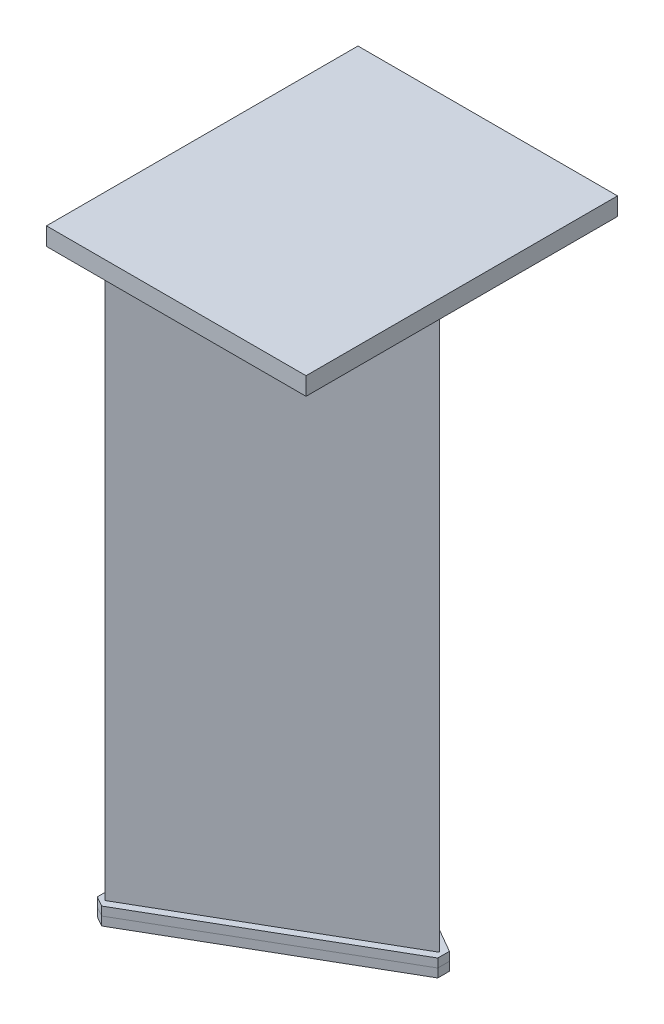
ISO-10303-21;
HEADER;
FILE_DESCRIPTION(('STEP AP214'),'2;1');
FILE_NAME('part.step','',(''),(''),'','','');
FILE_SCHEMA(('AUTOMOTIVE_DESIGN { 1 0 10303 214 1 1 1 1 }'));
ENDSEC;
DATA;
#1=APPLICATION_CONTEXT('core data for automotive mechanical design processes');
#2=APPLICATION_PROTOCOL_DEFINITION('international standard','automotive_design',2000,#1);
#3=PRODUCT_CONTEXT('',#1,'mechanical');
#4=PRODUCT('Part','Part','',(#3));
#5=PRODUCT_RELATED_PRODUCT_CATEGORY('part','',(#4));
#6=PRODUCT_DEFINITION_FORMATION('','',#4);
#7=PRODUCT_DEFINITION_CONTEXT('part definition',#1,'design');
#8=PRODUCT_DEFINITION('design','',#6,#7);
#9=PRODUCT_DEFINITION_SHAPE('','',#8);
#10=(LENGTH_UNIT() NAMED_UNIT(*) SI_UNIT(.MILLI.,.METRE.));
#11=(NAMED_UNIT(*) PLANE_ANGLE_UNIT() SI_UNIT($,.RADIAN.));
#12=(NAMED_UNIT(*) SI_UNIT($,.STERADIAN.) SOLID_ANGLE_UNIT());
#13=UNCERTAINTY_MEASURE_WITH_UNIT(LENGTH_MEASURE(1.E-05),#10,'distance_accuracy_value','');
#14=(GEOMETRIC_REPRESENTATION_CONTEXT(3) GLOBAL_UNCERTAINTY_ASSIGNED_CONTEXT((#13)) GLOBAL_UNIT_ASSIGNED_CONTEXT((#10,
#11,#12)) REPRESENTATION_CONTEXT('',''));
#15=CARTESIAN_POINT('',(0.,0.,0.));
#16=DIRECTION('',(0.,0.,1.));
#17=DIRECTION('',(1.,0.,0.));
#18=AXIS2_PLACEMENT_3D('',#15,#16,#17);
#19=CARTESIAN_POINT('',(-198.697304509099,-25.4,378.291426736751));
#20=DIRECTION('',(0.499999999999992,0.,-0.866025403784443));
#21=DIRECTION('',(-0.866025403784443,0.,-0.499999999999992));
#22=AXIS2_PLACEMENT_3D('',#19,#20,#21);
#23=PLANE('',#22);
#24=DIRECTION('',(-0.866025403784443,0.,-0.499999999999992));
#25=VECTOR('',#24,1.);
#26=CARTESIAN_POINT('',(-198.697304509099,0.,378.291426736751));
#27=LINE('',#26,#25);
#28=CARTESIAN_POINT('',(-198.697304509099,0.,378.291426736751));
#29=VERTEX_POINT('',#28);
#30=CARTESIAN_POINT('',(-228.261333333331,0.,361.222626736751));
#31=VERTEX_POINT('',#30);
#32=EDGE_CURVE('E128',#29,#31,#27,.T.);
#33=ORIENTED_EDGE('',*,*,#32,.T.);
#34=DIRECTION('',(0.,1.,0.));
#35=VECTOR('',#34,1.);
#36=CARTESIAN_POINT('',(-228.261333333331,-25.4,361.222626736751));
#37=LINE('',#36,#35);
#38=CARTESIAN_POINT('',(-228.261333333331,-25.4,361.222626736751));
#39=VERTEX_POINT('',#38);
#40=EDGE_CURVE('E12',#39,#31,#37,.T.);
#41=ORIENTED_EDGE('',*,*,#40,.F.);
#42=DIRECTION('',(-0.866025403784443,0.,-0.499999999999992));
#43=VECTOR('',#42,1.);
#44=CARTESIAN_POINT('',(-198.697304509099,-25.4,378.291426736751));
#45=LINE('',#44,#43);
#46=CARTESIAN_POINT('',(-198.697304509099,-25.4,378.291426736751));
#47=VERTEX_POINT('',#46);
#48=EDGE_CURVE('E138',#47,#39,#45,.T.);
#49=ORIENTED_EDGE('',*,*,#48,.F.);
#50=DIRECTION('',(0.,1.,0.));
#51=VECTOR('',#50,1.);
#52=CARTESIAN_POINT('',(-198.697304509099,-25.4,378.291426736751));
#53=LINE('',#52,#51);
#54=EDGE_CURVE('E124',#47,#29,#53,.T.);
#55=ORIENTED_EDGE('',*,*,#54,.T.);
#56=EDGE_LOOP('',(#33,#41,#49,#55));
#57=FACE_BOUND('',#56,.T.);
#58=ADVANCED_FACE('F44',(#57),#23,.F.);
#59=CARTESIAN_POINT('',(-228.261333333331,-25.4,361.222626736751));
#60=DIRECTION('',(1.,0.,0.));
#61=DIRECTION('',(0.,0.,-1.));
#62=AXIS2_PLACEMENT_3D('',#59,#60,#61);
#63=PLANE('',#62);
#64=DIRECTION('',(0.,0.,-1.));
#65=VECTOR('',#64,1.);
#66=CARTESIAN_POINT('',(-228.261333333331,0.,361.222626736751));
#67=LINE('',#66,#65);
#68=CARTESIAN_POINT('',(-228.261333333335,0.,-361.222626736746));
#69=VERTEX_POINT('',#68);
#70=EDGE_CURVE('E131',#31,#69,#67,.T.);
#71=ORIENTED_EDGE('',*,*,#70,.T.);
#72=DIRECTION('',(0.,1.,0.));
#73=VECTOR('',#72,1.);
#74=CARTESIAN_POINT('',(-228.261333333335,-25.4,-361.222626736746));
#75=LINE('',#74,#73);
#76=CARTESIAN_POINT('',(-228.261333333335,-25.4,-361.222626736746));
#77=VERTEX_POINT('',#76);
#78=EDGE_CURVE('E52',#77,#69,#75,.T.);
#79=ORIENTED_EDGE('',*,*,#78,.F.);
#80=DIRECTION('',(0.,0.,-1.));
#81=VECTOR('',#80,1.);
#82=CARTESIAN_POINT('',(-228.261333333331,-25.4,361.222626736751));
#83=LINE('',#82,#81);
#84=EDGE_CURVE('E97',#39,#77,#83,.T.);
#85=ORIENTED_EDGE('',*,*,#84,.F.);
#86=ORIENTED_EDGE('',*,*,#40,.T.);
#87=EDGE_LOOP('',(#71,#79,#85,#86));
#88=FACE_BOUND('',#87,.T.);
#89=ADVANCED_FACE('F162',(#88),#63,.F.);
#90=CARTESIAN_POINT('',(-228.261333333335,-25.4,-361.222626736746));
#91=DIRECTION('',(0.500000000000007,0.,0.866025403784435));
#92=DIRECTION('',(0.866025403784435,0.,-0.500000000000007));
#93=AXIS2_PLACEMENT_3D('',#90,#91,#92);
#94=PLANE('',#93);
#95=DIRECTION('',(0.866025403784435,0.,-0.500000000000007));
#96=VECTOR('',#95,1.);
#97=CARTESIAN_POINT('',(-228.261333333335,0.,-361.222626736746));
#98=LINE('',#97,#96);
#99=CARTESIAN_POINT('',(-198.697304509104,0.,-378.291426736747));
#100=VERTEX_POINT('',#99);
#101=EDGE_CURVE('E133',#69,#100,#98,.T.);
#102=ORIENTED_EDGE('',*,*,#101,.T.);
#103=DIRECTION('',(0.,1.,0.));
#104=VECTOR('',#103,1.);
#105=CARTESIAN_POINT('',(-198.697304509104,-25.4,-378.291426736747));
#106=LINE('',#105,#104);
#107=CARTESIAN_POINT('',(-198.697304509104,-25.4,-378.291426736747));
#108=VERTEX_POINT('',#107);
#109=EDGE_CURVE('E119',#108,#100,#106,.T.);
#110=ORIENTED_EDGE('',*,*,#109,.F.);
#111=DIRECTION('',(0.866025403784435,0.,-0.500000000000007));
#112=VECTOR('',#111,1.);
#113=CARTESIAN_POINT('',(-228.261333333335,-25.4,-361.222626736746));
#114=LINE('',#113,#112);
#115=EDGE_CURVE('E110',#77,#108,#114,.T.);
#116=ORIENTED_EDGE('',*,*,#115,.F.);
#117=ORIENTED_EDGE('',*,*,#78,.T.);
#118=EDGE_LOOP('',(#102,#110,#116,#117));
#119=FACE_BOUND('',#118,.T.);
#120=ADVANCED_FACE('F144',(#119),#94,.F.);
#121=CARTESIAN_POINT('',(-198.697304509104,-25.4,-378.291426736747));
#122=DIRECTION('',(-0.499999999999995,0.,0.866025403784442));
#123=DIRECTION('',(0.866025403784442,0.,0.499999999999995));
#124=AXIS2_PLACEMENT_3D('',#121,#122,#123);
#125=PLANE('',#124);
#126=DIRECTION('',(0.866025403784442,0.,0.499999999999995));
#127=VECTOR('',#126,1.);
#128=CARTESIAN_POINT('',(-198.697304509104,0.,-378.291426736747));
#129=LINE('',#128,#127);
#130=CARTESIAN_POINT('',(426.958637842435,0.,-17.0688000000018));
#131=VERTEX_POINT('',#130);
#132=EDGE_CURVE('E118',#100,#131,#129,.T.);
#133=ORIENTED_EDGE('',*,*,#132,.T.);
#134=DIRECTION('',(0.,1.,0.));
#135=VECTOR('',#134,1.);
#136=CARTESIAN_POINT('',(426.958637842435,-25.4,-17.0688000000018));
#137=LINE('',#136,#135);
#138=CARTESIAN_POINT('',(426.958637842435,-25.4,-17.0688000000018));
#139=VERTEX_POINT('',#138);
#140=EDGE_CURVE('E115',#139,#131,#137,.T.);
#141=ORIENTED_EDGE('',*,*,#140,.F.);
#142=DIRECTION('',(0.866025403784442,0.,0.499999999999995));
#143=VECTOR('',#142,1.);
#144=CARTESIAN_POINT('',(-198.697304509104,-25.4,-378.291426736747));
#145=LINE('',#144,#143);
#146=EDGE_CURVE('E104',#108,#139,#145,.T.);
#147=ORIENTED_EDGE('',*,*,#146,.F.);
#148=ORIENTED_EDGE('',*,*,#109,.T.);
#149=EDGE_LOOP('',(#133,#141,#147,#148));
#150=FACE_BOUND('',#149,.T.);
#151=ADVANCED_FACE('F116',(#150),#125,.F.);
#152=CARTESIAN_POINT('',(426.958637842435,-25.4,-17.0688000000018));
#153=DIRECTION('',(-1.,0.,0.));
#154=DIRECTION('',(0.,0.,1.));
#155=AXIS2_PLACEMENT_3D('',#152,#153,#154);
#156=PLANE('',#155);
#157=DIRECTION('',(0.,0.,1.));
#158=VECTOR('',#157,1.);
#159=CARTESIAN_POINT('',(426.958637842435,0.,-17.0688000000018));
#160=LINE('',#159,#158);
#161=CARTESIAN_POINT('',(426.958637842435,0.,17.0687999999982));
#162=VERTEX_POINT('',#161);
#163=EDGE_CURVE('E83',#131,#162,#160,.T.);
#164=ORIENTED_EDGE('',*,*,#163,.T.);
#165=DIRECTION('',(0.,1.,0.));
#166=VECTOR('',#165,1.);
#167=CARTESIAN_POINT('',(426.958637842435,-25.4,17.0687999999982));
#168=LINE('',#167,#166);
#169=CARTESIAN_POINT('',(426.958637842435,-25.4,17.0687999999982));
#170=VERTEX_POINT('',#169);
#171=EDGE_CURVE('E120',#170,#162,#168,.T.);
#172=ORIENTED_EDGE('',*,*,#171,.F.);
#173=DIRECTION('',(0.,0.,1.));
#174=VECTOR('',#173,1.);
#175=CARTESIAN_POINT('',(426.958637842435,-25.4,-17.0688000000018));
#176=LINE('',#175,#174);
#177=EDGE_CURVE('E108',#139,#170,#176,.T.);
#178=ORIENTED_EDGE('',*,*,#177,.F.);
#179=ORIENTED_EDGE('',*,*,#140,.T.);
#180=EDGE_LOOP('',(#164,#172,#178,#179));
#181=FACE_BOUND('',#180,.T.);
#182=ADVANCED_FACE('F122',(#181),#156,.F.);
#183=CARTESIAN_POINT('',(426.958637842435,-25.4,17.0687999999982));
#184=DIRECTION('',(-0.500000000000005,0.,-0.866025403784436));
#185=DIRECTION('',(-0.866025403784436,0.,0.500000000000005));
#186=AXIS2_PLACEMENT_3D('',#183,#184,#185);
#187=PLANE('',#186);
#188=DIRECTION('',(-0.866025403784436,0.,0.500000000000005));
#189=VECTOR('',#188,1.);
#190=CARTESIAN_POINT('',(426.958637842435,0.,17.0687999999982));
#191=LINE('',#190,#189);
#192=EDGE_CURVE('E89',#162,#29,#191,.T.);
#193=ORIENTED_EDGE('',*,*,#192,.T.);
#194=ORIENTED_EDGE('',*,*,#54,.F.);
#195=DIRECTION('',(-0.866025403784436,0.,0.500000000000005));
#196=VECTOR('',#195,1.);
#197=CARTESIAN_POINT('',(426.958637842435,-25.4,17.0687999999982));
#198=LINE('',#197,#196);
#199=EDGE_CURVE('E60',#170,#47,#198,.T.);
#200=ORIENTED_EDGE('',*,*,#199,.F.);
#201=ORIENTED_EDGE('',*,*,#171,.T.);
#202=EDGE_LOOP('',(#193,#194,#200,#201));
#203=FACE_BOUND('',#202,.T.);
#204=ADVANCED_FACE('F151',(#203),#187,.F.);
#205=CARTESIAN_POINT('',(-228.261333333331,-25.4,361.222626736751));
#206=DIRECTION('',(0.,-1.,0.));
#207=DIRECTION('',(0.,0.,-1.));
#208=AXIS2_PLACEMENT_3D('',#205,#206,#207);
#209=PLANE('',#208);
#210=ORIENTED_EDGE('',*,*,#48,.T.);
#211=ORIENTED_EDGE('',*,*,#84,.T.);
#212=ORIENTED_EDGE('',*,*,#115,.T.);
#213=ORIENTED_EDGE('',*,*,#146,.T.);
#214=ORIENTED_EDGE('',*,*,#177,.T.);
#215=ORIENTED_EDGE('',*,*,#199,.T.);
#216=EDGE_LOOP('',(#210,#211,#212,#213,#214,#215));
#217=FACE_BOUND('',#216,.T.);
#218=ADVANCED_FACE('F106',(#217),#209,.T.);
#219=CARTESIAN_POINT('',(-228.261333333331,0.,361.222626736751));
#220=DIRECTION('',(0.,-1.,0.));
#221=DIRECTION('',(0.,0.,-1.));
#222=AXIS2_PLACEMENT_3D('',#219,#220,#221);
#223=PLANE('',#222);
#224=ORIENTED_EDGE('',*,*,#32,.F.);
#225=ORIENTED_EDGE('',*,*,#192,.F.);
#226=ORIENTED_EDGE('',*,*,#163,.F.);
#227=ORIENTED_EDGE('',*,*,#132,.F.);
#228=ORIENTED_EDGE('',*,*,#101,.F.);
#229=ORIENTED_EDGE('',*,*,#70,.F.);
#230=EDGE_LOOP('',(#224,#225,#226,#227,#228,#229));
#231=FACE_BOUND('',#230,.T.);
#232=ADVANCED_FACE('F147',(#231),#223,.F.);
#233=CLOSED_SHELL('',(#58,#89,#120,#151,#182,#204,#218,#232));
#234=MANIFOLD_SOLID_BREP('B2',#233);
#235=CARTESIAN_POINT('',(-207.433333333338,2650.72795165701,-359.285072516704));
#236=DIRECTION('',(0.5,0.,-0.866025403784438));
#237=DIRECTION('',(-0.866025403784438,0.,-0.5));
#238=AXIS2_PLACEMENT_3D('',#235,#236,#237);
#239=PLANE('',#238);
#240=DIRECTION('',(-0.866025403784438,0.,-0.5));
#241=VECTOR('',#240,1.);
#242=CARTESIAN_POINT('',(-207.433333333338,1700.149,-359.285072516704));
#243=LINE('',#242,#241);
#244=CARTESIAN_POINT('',(414.866666666662,1700.149,1.0886965094513E-13));
#245=VERTEX_POINT('',#244);
#246=CARTESIAN_POINT('',(-207.433333333338,1700.149,-359.285072516704));
#247=VERTEX_POINT('',#246);
#248=EDGE_CURVE('E238',#245,#247,#243,.T.);
#249=ORIENTED_EDGE('',*,*,#248,.F.);
#250=DIRECTION('',(0.,-1.,0.));
#251=VECTOR('',#250,1.);
#252=CARTESIAN_POINT('',(414.866666666662,2650.72795165701,0.));
#253=LINE('',#252,#251);
#254=CARTESIAN_POINT('',(414.866666666662,25.4,0.));
#255=VERTEX_POINT('',#254);
#256=EDGE_CURVE('E258',#245,#255,#253,.T.);
#257=ORIENTED_EDGE('',*,*,#256,.T.);
#258=DIRECTION('',(0.866025403784438,0.,0.5));
#259=VECTOR('',#258,1.);
#260=CARTESIAN_POINT('',(-207.433333333338,25.4,-359.285072516704));
#261=LINE('',#260,#259);
#262=CARTESIAN_POINT('',(-207.433333333338,25.4,-359.285072516704));
#263=VERTEX_POINT('',#262);
#264=EDGE_CURVE('E262',#263,#255,#261,.T.);
#265=ORIENTED_EDGE('',*,*,#264,.F.);
#266=DIRECTION('',(0.,-1.,0.));
#267=VECTOR('',#266,1.);
#268=CARTESIAN_POINT('',(-207.433333333338,2650.72795165701,-359.285072516704));
#269=LINE('',#268,#267);
#270=EDGE_CURVE('E280',#247,#263,#269,.T.);
#271=ORIENTED_EDGE('',*,*,#270,.F.);
#272=EDGE_LOOP('',(#249,#257,#265,#271));
#273=FACE_BOUND('',#272,.T.);
#274=ADVANCED_FACE('F230',(#273),#239,.T.);
#275=CARTESIAN_POINT('',(-207.433333333338,2650.72795165701,359.285072516704));
#276=DIRECTION('',(-1.,0.,0.));
#277=DIRECTION('',(0.,0.,1.));
#278=AXIS2_PLACEMENT_3D('',#275,#276,#277);
#279=PLANE('',#278);
#280=DIRECTION('',(0.,0.,1.));
#281=VECTOR('',#280,1.);
#282=CARTESIAN_POINT('',(-207.433333333338,1700.149,359.285072516704));
#283=LINE('',#282,#281);
#284=CARTESIAN_POINT('',(-207.433333333338,1700.149,359.285072516704));
#285=VERTEX_POINT('',#284);
#286=EDGE_CURVE('E282',#247,#285,#283,.T.);
#287=ORIENTED_EDGE('',*,*,#286,.F.);
#288=ORIENTED_EDGE('',*,*,#270,.T.);
#289=DIRECTION('',(0.,0.,-1.));
#290=VECTOR('',#289,1.);
#291=CARTESIAN_POINT('',(-207.433333333338,25.4,359.285072516704));
#292=LINE('',#291,#290);
#293=CARTESIAN_POINT('',(-207.433333333338,25.4,359.285072516704));
#294=VERTEX_POINT('',#293);
#295=EDGE_CURVE('E266',#294,#263,#292,.T.);
#296=ORIENTED_EDGE('',*,*,#295,.F.);
#297=DIRECTION('',(0.,-1.,0.));
#298=VECTOR('',#297,1.);
#299=CARTESIAN_POINT('',(-207.433333333338,2650.72795165701,359.285072516704));
#300=LINE('',#299,#298);
#301=EDGE_CURVE('E265',#285,#294,#300,.T.);
#302=ORIENTED_EDGE('',*,*,#301,.F.);
#303=EDGE_LOOP('',(#287,#288,#296,#302));
#304=FACE_BOUND('',#303,.T.);
#305=ADVANCED_FACE('F286',(#304),#279,.T.);
#306=CARTESIAN_POINT('',(414.866666666662,2650.72795165701,0.));
#307=DIRECTION('',(0.5,0.,0.866025403784439));
#308=DIRECTION('',(0.866025403784439,0.,-0.5));
#309=AXIS2_PLACEMENT_3D('',#306,#307,#308);
#310=PLANE('',#309);
#311=DIRECTION('',(0.866025403784439,0.,-0.5));
#312=VECTOR('',#311,1.);
#313=CARTESIAN_POINT('',(414.866666666662,1700.149,0.));
#314=LINE('',#313,#312);
#315=EDGE_CURVE('E42',#285,#245,#314,.T.);
#316=ORIENTED_EDGE('',*,*,#315,.F.);
#317=ORIENTED_EDGE('',*,*,#301,.T.);
#318=DIRECTION('',(-0.866025403784439,0.,0.5));
#319=VECTOR('',#318,1.);
#320=CARTESIAN_POINT('',(414.866666666662,25.4,0.));
#321=LINE('',#320,#319);
#322=EDGE_CURVE('E268',#255,#294,#321,.T.);
#323=ORIENTED_EDGE('',*,*,#322,.F.);
#324=ORIENTED_EDGE('',*,*,#256,.F.);
#325=EDGE_LOOP('',(#316,#317,#323,#324));
#326=FACE_BOUND('',#325,.T.);
#327=ADVANCED_FACE('F269',(#326),#310,.T.);
#328=CARTESIAN_POINT('',(414.866666666662,25.4,1.32208155744464E-13));
#329=DIRECTION('',(0.,-1.,0.));
#330=DIRECTION('',(0.,0.,-1.));
#331=AXIS2_PLACEMENT_3D('',#328,#329,#330);
#332=PLANE('',#331);
#333=ORIENTED_EDGE('',*,*,#264,.T.);
#334=ORIENTED_EDGE('',*,*,#322,.T.);
#335=ORIENTED_EDGE('',*,*,#295,.T.);
#336=EDGE_LOOP('',(#333,#334,#335));
#337=FACE_BOUND('',#336,.T.);
#338=ADVANCED_FACE('F274',(#337),#332,.T.);
#339=CARTESIAN_POINT('',(-281.65134774545,1700.149,-457.2));
#340=DIRECTION('',(0.,-1.,0.));
#341=DIRECTION('',(0.,0.,-1.));
#342=AXIS2_PLACEMENT_3D('',#339,#340,#341);
#343=PLANE('',#342);
#344=ORIENTED_EDGE('',*,*,#248,.T.);
#345=ORIENTED_EDGE('',*,*,#286,.T.);
#346=ORIENTED_EDGE('',*,*,#315,.T.);
#347=EDGE_LOOP('',(#344,#345,#346));
#348=FACE_BOUND('',#347,.T.);
#349=ADVANCED_FACE('F285',(#348),#343,.F.);
#350=CLOSED_SHELL('',(#274,#305,#327,#338,#349));
#351=MANIFOLD_SOLID_BREP('B6',#350);
#352=CARTESIAN_POINT('',(-281.65134774545,1700.149,457.2));
#353=DIRECTION('',(-1.,0.,0.));
#354=DIRECTION('',(0.,0.,1.));
#355=AXIS2_PLACEMENT_3D('',#352,#353,#354);
#356=PLANE('',#355);
#357=DIRECTION('',(0.,0.,1.));
#358=VECTOR('',#357,1.);
#359=CARTESIAN_POINT('',(-281.65134774545,1752.6,457.2));
#360=LINE('',#359,#358);
#361=CARTESIAN_POINT('',(-281.65134774545,1752.6,-457.2));
#362=VERTEX_POINT('',#361);
#363=CARTESIAN_POINT('',(-281.65134774545,1752.6,457.2));
#364=VERTEX_POINT('',#363);
#365=EDGE_CURVE('E401',#362,#364,#360,.T.);
#366=ORIENTED_EDGE('',*,*,#365,.F.);
#367=DIRECTION('',(0.,1.,0.));
#368=VECTOR('',#367,1.);
#369=CARTESIAN_POINT('',(-281.65134774545,1700.149,-457.2));
#370=LINE('',#369,#368);
#371=CARTESIAN_POINT('',(-281.65134774545,1700.149,-457.2));
#372=VERTEX_POINT('',#371);
#373=EDGE_CURVE('E228',#372,#362,#370,.T.);
#374=ORIENTED_EDGE('',*,*,#373,.F.);
#375=DIRECTION('',(0.,0.,1.));
#376=VECTOR('',#375,1.);
#377=CARTESIAN_POINT('',(-281.65134774545,1700.149,457.2));
#378=LINE('',#377,#376);
#379=CARTESIAN_POINT('',(-281.65134774545,1700.149,457.2));
#380=VERTEX_POINT('',#379);
#381=EDGE_CURVE('E395',#372,#380,#378,.T.);
#382=ORIENTED_EDGE('',*,*,#381,.T.);
#383=DIRECTION('',(0.,1.,0.));
#384=VECTOR('',#383,1.);
#385=CARTESIAN_POINT('',(-281.65134774545,1700.149,457.2));
#386=LINE('',#385,#384);
#387=EDGE_CURVE('E340',#380,#364,#386,.T.);
#388=ORIENTED_EDGE('',*,*,#387,.T.);
#389=EDGE_LOOP('',(#366,#374,#382,#388));
#390=FACE_BOUND('',#389,.T.);
#391=ADVANCED_FACE('F337',(#390),#356,.T.);
#392=CARTESIAN_POINT('',(-281.65134774545,1700.149,-457.2));
#393=DIRECTION('',(0.,0.,-1.));
#394=DIRECTION('',(-1.,0.,0.));
#395=AXIS2_PLACEMENT_3D('',#392,#393,#394);
#396=PLANE('',#395);
#397=DIRECTION('',(-1.,0.,0.));
#398=VECTOR('',#397,1.);
#399=CARTESIAN_POINT('',(-281.65134774545,1752.6,-457.2));
#400=LINE('',#399,#398);
#401=CARTESIAN_POINT('',(480.34865225455,1752.6,-457.2));
#402=VERTEX_POINT('',#401);
#403=EDGE_CURVE('E397',#402,#362,#400,.T.);
#404=ORIENTED_EDGE('',*,*,#403,.F.);
#405=DIRECTION('',(0.,1.,0.));
#406=VECTOR('',#405,1.);
#407=CARTESIAN_POINT('',(480.34865225455,1700.149,-457.2));
#408=LINE('',#407,#406);
#409=CARTESIAN_POINT('',(480.34865225455,1700.149,-457.2));
#410=VERTEX_POINT('',#409);
#411=EDGE_CURVE('E346',#410,#402,#408,.T.);
#412=ORIENTED_EDGE('',*,*,#411,.F.);
#413=DIRECTION('',(-1.,0.,0.));
#414=VECTOR('',#413,1.);
#415=CARTESIAN_POINT('',(-281.65134774545,1700.149,-457.2));
#416=LINE('',#415,#414);
#417=EDGE_CURVE('E392',#410,#372,#416,.T.);
#418=ORIENTED_EDGE('',*,*,#417,.T.);
#419=ORIENTED_EDGE('',*,*,#373,.T.);
#420=EDGE_LOOP('',(#404,#412,#418,#419));
#421=FACE_BOUND('',#420,.T.);
#422=ADVANCED_FACE('F411',(#421),#396,.T.);
#423=CARTESIAN_POINT('',(480.34865225455,1700.149,457.2));
#424=DIRECTION('',(1.,0.,0.));
#425=DIRECTION('',(0.,0.,-1.));
#426=AXIS2_PLACEMENT_3D('',#423,#424,#425);
#427=PLANE('',#426);
#428=DIRECTION('',(0.,0.,-1.));
#429=VECTOR('',#428,1.);
#430=CARTESIAN_POINT('',(480.34865225455,1752.6,457.2));
#431=LINE('',#430,#429);
#432=CARTESIAN_POINT('',(480.34865225455,1752.6,457.2));
#433=VERTEX_POINT('',#432);
#434=EDGE_CURVE('E387',#433,#402,#431,.T.);
#435=ORIENTED_EDGE('',*,*,#434,.F.);
#436=DIRECTION('',(0.,1.,0.));
#437=VECTOR('',#436,1.);
#438=CARTESIAN_POINT('',(480.34865225455,1700.149,457.2));
#439=LINE('',#438,#437);
#440=CARTESIAN_POINT('',(480.34865225455,1700.149,457.2));
#441=VERTEX_POINT('',#440);
#442=EDGE_CURVE('E382',#441,#433,#439,.T.);
#443=ORIENTED_EDGE('',*,*,#442,.F.);
#444=DIRECTION('',(0.,0.,-1.));
#445=VECTOR('',#444,1.);
#446=CARTESIAN_POINT('',(480.34865225455,1700.149,457.2));
#447=LINE('',#446,#445);
#448=EDGE_CURVE('E385',#441,#410,#447,.T.);
#449=ORIENTED_EDGE('',*,*,#448,.T.);
#450=ORIENTED_EDGE('',*,*,#411,.T.);
#451=EDGE_LOOP('',(#435,#443,#449,#450));
#452=FACE_BOUND('',#451,.T.);
#453=ADVANCED_FACE('F384',(#452),#427,.T.);
#454=CARTESIAN_POINT('',(-281.65134774545,1700.149,457.2));
#455=DIRECTION('',(0.,0.,1.));
#456=DIRECTION('',(1.,0.,0.));
#457=AXIS2_PLACEMENT_3D('',#454,#455,#456);
#458=PLANE('',#457);
#459=DIRECTION('',(1.,0.,0.));
#460=VECTOR('',#459,1.);
#461=CARTESIAN_POINT('',(-281.65134774545,1752.6,457.2));
#462=LINE('',#461,#460);
#463=EDGE_CURVE('E404',#364,#433,#462,.T.);
#464=ORIENTED_EDGE('',*,*,#463,.F.);
#465=ORIENTED_EDGE('',*,*,#387,.F.);
#466=DIRECTION('',(1.,0.,0.));
#467=VECTOR('',#466,1.);
#468=CARTESIAN_POINT('',(-281.65134774545,1700.149,457.2));
#469=LINE('',#468,#467);
#470=EDGE_CURVE('E391',#380,#441,#469,.T.);
#471=ORIENTED_EDGE('',*,*,#470,.T.);
#472=ORIENTED_EDGE('',*,*,#442,.T.);
#473=EDGE_LOOP('',(#464,#465,#471,#472));
#474=FACE_BOUND('',#473,.T.);
#475=ADVANCED_FACE('F394',(#474),#458,.T.);
#476=CARTESIAN_POINT('',(-281.65134774545,1700.149,-457.2));
#477=DIRECTION('',(0.,-1.,0.));
#478=DIRECTION('',(0.,0.,-1.));
#479=AXIS2_PLACEMENT_3D('',#476,#477,#478);
#480=PLANE('',#479);
#481=ORIENTED_EDGE('',*,*,#381,.F.);
#482=ORIENTED_EDGE('',*,*,#417,.F.);
#483=ORIENTED_EDGE('',*,*,#448,.F.);
#484=ORIENTED_EDGE('',*,*,#470,.F.);
#485=EDGE_LOOP('',(#481,#482,#483,#484));
#486=FACE_BOUND('',#485,.T.);
#487=ADVANCED_FACE('F390',(#486),#480,.T.);
#488=CARTESIAN_POINT('',(-281.65134774545,1752.6,-457.2));
#489=DIRECTION('',(0.,-1.,0.));
#490=DIRECTION('',(0.,0.,-1.));
#491=AXIS2_PLACEMENT_3D('',#488,#489,#490);
#492=PLANE('',#491);
#493=ORIENTED_EDGE('',*,*,#365,.T.);
#494=ORIENTED_EDGE('',*,*,#463,.T.);
#495=ORIENTED_EDGE('',*,*,#434,.T.);
#496=ORIENTED_EDGE('',*,*,#403,.T.);
#497=EDGE_LOOP('',(#493,#494,#495,#496));
#498=FACE_BOUND('',#497,.T.);
#499=ADVANCED_FACE('F410',(#498),#492,.F.);
#500=CLOSED_SHELL('',(#391,#422,#453,#475,#487,#499));
#501=MANIFOLD_SOLID_BREP('B36',#500);
#502=CARTESIAN_POINT('',(-228.261333333335,25.4,-361.222626736746));
#503=DIRECTION('',(0.500000000000006,0.,0.866025403784435));
#504=DIRECTION('',(0.866025403784435,0.,-0.500000000000006));
#505=AXIS2_PLACEMENT_3D('',#502,#503,#504);
#506=PLANE('',#505);
#507=DIRECTION('',(-0.866025403784435,0.,0.500000000000006));
#508=VECTOR('',#507,1.);
#509=CARTESIAN_POINT('',(-228.261333333335,0.,-361.222626736746));
#510=LINE('',#509,#508);
#511=CARTESIAN_POINT('',(-198.697304509104,0.,-378.291426736747));
#512=VERTEX_POINT('',#511);
#513=CARTESIAN_POINT('',(-228.261333333335,0.,-361.222626736746));
#514=VERTEX_POINT('',#513);
#515=EDGE_CURVE('E545',#512,#514,#510,.T.);
#516=ORIENTED_EDGE('',*,*,#515,.T.);
#517=DIRECTION('',(0.,-1.,0.));
#518=VECTOR('',#517,1.);
#519=CARTESIAN_POINT('',(-228.261333333335,25.4,-361.222626736746));
#520=LINE('',#519,#518);
#521=CARTESIAN_POINT('',(-228.261333333335,25.4,-361.222626736746));
#522=VERTEX_POINT('',#521);
#523=EDGE_CURVE('E335',#522,#514,#520,.T.);
#524=ORIENTED_EDGE('',*,*,#523,.F.);
#525=DIRECTION('',(-0.866025403784435,0.,0.500000000000006));
#526=VECTOR('',#525,1.);
#527=CARTESIAN_POINT('',(-228.261333333335,25.4,-361.222626736746));
#528=LINE('',#527,#526);
#529=CARTESIAN_POINT('',(-198.697304509104,25.4,-378.291426736747));
#530=VERTEX_POINT('',#529);
#531=EDGE_CURVE('E555',#530,#522,#528,.T.);
#532=ORIENTED_EDGE('',*,*,#531,.F.);
#533=DIRECTION('',(0.,-1.,0.));
#534=VECTOR('',#533,1.);
#535=CARTESIAN_POINT('',(-198.697304509104,25.4,-378.291426736747));
#536=LINE('',#535,#534);
#537=EDGE_CURVE('E541',#530,#512,#536,.T.);
#538=ORIENTED_EDGE('',*,*,#537,.T.);
#539=EDGE_LOOP('',(#516,#524,#532,#538));
#540=FACE_BOUND('',#539,.T.);
#541=ADVANCED_FACE('F461',(#540),#506,.F.);
#542=CARTESIAN_POINT('',(-228.261333333335,25.4,-361.222626736746));
#543=DIRECTION('',(1.,0.,0.));
#544=DIRECTION('',(0.,0.,-1.));
#545=AXIS2_PLACEMENT_3D('',#542,#543,#544);
#546=PLANE('',#545);
#547=DIRECTION('',(0.,0.,1.));
#548=VECTOR('',#547,1.);
#549=CARTESIAN_POINT('',(-228.261333333335,0.,-361.222626736746));
#550=LINE('',#549,#548);
#551=CARTESIAN_POINT('',(-228.261333333331,0.,361.222626736751));
#552=VERTEX_POINT('',#551);
#553=EDGE_CURVE('E548',#514,#552,#550,.T.);
#554=ORIENTED_EDGE('',*,*,#553,.T.);
#555=DIRECTION('',(0.,-1.,0.));
#556=VECTOR('',#555,1.);
#557=CARTESIAN_POINT('',(-228.261333333331,25.4,361.222626736751));
#558=LINE('',#557,#556);
#559=CARTESIAN_POINT('',(-228.261333333331,25.4,361.222626736751));
#560=VERTEX_POINT('',#559);
#561=EDGE_CURVE('E469',#560,#552,#558,.T.);
#562=ORIENTED_EDGE('',*,*,#561,.F.);
#563=DIRECTION('',(0.,0.,1.));
#564=VECTOR('',#563,1.);
#565=CARTESIAN_POINT('',(-228.261333333335,25.4,-361.222626736746));
#566=LINE('',#565,#564);
#567=EDGE_CURVE('E514',#522,#560,#566,.T.);
#568=ORIENTED_EDGE('',*,*,#567,.F.);
#569=ORIENTED_EDGE('',*,*,#523,.T.);
#570=EDGE_LOOP('',(#554,#562,#568,#569));
#571=FACE_BOUND('',#570,.T.);
#572=ADVANCED_FACE('F579',(#571),#546,.F.);
#573=CARTESIAN_POINT('',(-198.697304509099,25.4,378.291426736751));
#574=DIRECTION('',(0.499999999999993,0.,-0.866025403784443));
#575=DIRECTION('',(-0.866025403784443,0.,-0.499999999999993));
#576=AXIS2_PLACEMENT_3D('',#573,#574,#575);
#577=PLANE('',#576);
#578=DIRECTION('',(0.866025403784442,0.,0.499999999999993));
#579=VECTOR('',#578,1.);
#580=CARTESIAN_POINT('',(-198.697304509099,0.,378.291426736751));
#581=LINE('',#580,#579);
#582=CARTESIAN_POINT('',(-198.697304509099,0.,378.291426736751));
#583=VERTEX_POINT('',#582);
#584=EDGE_CURVE('E550',#552,#583,#581,.T.);
#585=ORIENTED_EDGE('',*,*,#584,.T.);
#586=DIRECTION('',(0.,-1.,0.));
#587=VECTOR('',#586,1.);
#588=CARTESIAN_POINT('',(-198.697304509099,25.4,378.291426736751));
#589=LINE('',#588,#587);
#590=CARTESIAN_POINT('',(-198.697304509099,25.4,378.291426736751));
#591=VERTEX_POINT('',#590);
#592=EDGE_CURVE('E536',#591,#583,#589,.T.);
#593=ORIENTED_EDGE('',*,*,#592,.F.);
#594=DIRECTION('',(0.866025403784442,0.,0.499999999999993));
#595=VECTOR('',#594,1.);
#596=CARTESIAN_POINT('',(-198.697304509099,25.4,378.291426736751));
#597=LINE('',#596,#595);
#598=EDGE_CURVE('E527',#560,#591,#597,.T.);
#599=ORIENTED_EDGE('',*,*,#598,.F.);
#600=ORIENTED_EDGE('',*,*,#561,.T.);
#601=EDGE_LOOP('',(#585,#593,#599,#600));
#602=FACE_BOUND('',#601,.T.);
#603=ADVANCED_FACE('F561',(#602),#577,.F.);
#604=CARTESIAN_POINT('',(-198.697304509099,25.4,378.291426736751));
#605=DIRECTION('',(-0.500000000000005,0.,-0.866025403784436));
#606=DIRECTION('',(-0.866025403784436,0.,0.500000000000005));
#607=AXIS2_PLACEMENT_3D('',#604,#605,#606);
#608=PLANE('',#607);
#609=DIRECTION('',(0.866025403784436,0.,-0.500000000000005));
#610=VECTOR('',#609,1.);
#611=CARTESIAN_POINT('',(-198.697304509099,0.,378.291426736751));
#612=LINE('',#611,#610);
#613=CARTESIAN_POINT('',(426.958637842435,0.,17.0687999999982));
#614=VERTEX_POINT('',#613);
#615=EDGE_CURVE('E535',#583,#614,#612,.T.);
#616=ORIENTED_EDGE('',*,*,#615,.T.);
#617=DIRECTION('',(0.,-1.,0.));
#618=VECTOR('',#617,1.);
#619=CARTESIAN_POINT('',(426.958637842435,25.4,17.0687999999982));
#620=LINE('',#619,#618);
#621=CARTESIAN_POINT('',(426.958637842435,25.4,17.0687999999982));
#622=VERTEX_POINT('',#621);
#623=EDGE_CURVE('E532',#622,#614,#620,.T.);
#624=ORIENTED_EDGE('',*,*,#623,.F.);
#625=DIRECTION('',(0.866025403784436,0.,-0.500000000000005));
#626=VECTOR('',#625,1.);
#627=CARTESIAN_POINT('',(-198.697304509099,25.4,378.291426736751));
#628=LINE('',#627,#626);
#629=EDGE_CURVE('E521',#591,#622,#628,.T.);
#630=ORIENTED_EDGE('',*,*,#629,.F.);
#631=ORIENTED_EDGE('',*,*,#592,.T.);
#632=EDGE_LOOP('',(#616,#624,#630,#631));
#633=FACE_BOUND('',#632,.T.);
#634=ADVANCED_FACE('F533',(#633),#608,.F.);
#635=CARTESIAN_POINT('',(426.958637842435,25.4,-17.0688000000018));
#636=DIRECTION('',(-1.,0.,0.));
#637=DIRECTION('',(0.,0.,1.));
#638=AXIS2_PLACEMENT_3D('',#635,#636,#637);
#639=PLANE('',#638);
#640=DIRECTION('',(0.,0.,-1.));
#641=VECTOR('',#640,1.);
#642=CARTESIAN_POINT('',(426.958637842435,0.,-17.0688000000018));
#643=LINE('',#642,#641);
#644=CARTESIAN_POINT('',(426.958637842435,0.,-17.0688000000018));
#645=VERTEX_POINT('',#644);
#646=EDGE_CURVE('E500',#614,#645,#643,.T.);
#647=ORIENTED_EDGE('',*,*,#646,.T.);
#648=DIRECTION('',(0.,-1.,0.));
#649=VECTOR('',#648,1.);
#650=CARTESIAN_POINT('',(426.958637842435,25.4,-17.0688000000018));
#651=LINE('',#650,#649);
#652=CARTESIAN_POINT('',(426.958637842435,25.4,-17.0688000000018));
#653=VERTEX_POINT('',#652);
#654=EDGE_CURVE('E537',#653,#645,#651,.T.);
#655=ORIENTED_EDGE('',*,*,#654,.F.);
#656=DIRECTION('',(0.,0.,-1.));
#657=VECTOR('',#656,1.);
#658=CARTESIAN_POINT('',(426.958637842435,25.4,-17.0688000000018));
#659=LINE('',#658,#657);
#660=EDGE_CURVE('E525',#622,#653,#659,.T.);
#661=ORIENTED_EDGE('',*,*,#660,.F.);
#662=ORIENTED_EDGE('',*,*,#623,.T.);
#663=EDGE_LOOP('',(#647,#655,#661,#662));
#664=FACE_BOUND('',#663,.T.);
#665=ADVANCED_FACE('F539',(#664),#639,.F.);
#666=CARTESIAN_POINT('',(426.958637842435,25.4,-17.0688000000018));
#667=DIRECTION('',(-0.499999999999995,0.,0.866025403784442));
#668=DIRECTION('',(0.866025403784442,0.,0.499999999999995));
#669=AXIS2_PLACEMENT_3D('',#666,#667,#668);
#670=PLANE('',#669);
#671=DIRECTION('',(-0.866025403784442,0.,-0.499999999999995));
#672=VECTOR('',#671,1.);
#673=CARTESIAN_POINT('',(426.958637842435,0.,-17.0688000000018));
#674=LINE('',#673,#672);
#675=EDGE_CURVE('E506',#645,#512,#674,.T.);
#676=ORIENTED_EDGE('',*,*,#675,.T.);
#677=ORIENTED_EDGE('',*,*,#537,.F.);
#678=DIRECTION('',(-0.866025403784442,0.,-0.499999999999995));
#679=VECTOR('',#678,1.);
#680=CARTESIAN_POINT('',(426.958637842435,25.4,-17.0688000000018));
#681=LINE('',#680,#679);
#682=EDGE_CURVE('E477',#653,#530,#681,.T.);
#683=ORIENTED_EDGE('',*,*,#682,.F.);
#684=ORIENTED_EDGE('',*,*,#654,.T.);
#685=EDGE_LOOP('',(#676,#677,#683,#684));
#686=FACE_BOUND('',#685,.T.);
#687=ADVANCED_FACE('F568',(#686),#670,.F.);
#688=CARTESIAN_POINT('',(-198.697304509104,25.4,-378.291426736747));
#689=DIRECTION('',(0.,1.,0.));
#690=DIRECTION('',(0.,0.,1.));
#691=AXIS2_PLACEMENT_3D('',#688,#689,#690);
#692=PLANE('',#691);
#693=ORIENTED_EDGE('',*,*,#531,.T.);
#694=ORIENTED_EDGE('',*,*,#567,.T.);
#695=ORIENTED_EDGE('',*,*,#598,.T.);
#696=ORIENTED_EDGE('',*,*,#629,.T.);
#697=ORIENTED_EDGE('',*,*,#660,.T.);
#698=ORIENTED_EDGE('',*,*,#682,.T.);
#699=EDGE_LOOP('',(#693,#694,#695,#696,#697,#698));
#700=FACE_BOUND('',#699,.T.);
#701=ADVANCED_FACE('F523',(#700),#692,.T.);
#702=CARTESIAN_POINT('',(-198.697304509104,0.,-378.291426736747));
#703=DIRECTION('',(0.,1.,0.));
#704=DIRECTION('',(0.,0.,1.));
#705=AXIS2_PLACEMENT_3D('',#702,#703,#704);
#706=PLANE('',#705);
#707=ORIENTED_EDGE('',*,*,#515,.F.);
#708=ORIENTED_EDGE('',*,*,#675,.F.);
#709=ORIENTED_EDGE('',*,*,#646,.F.);
#710=ORIENTED_EDGE('',*,*,#615,.F.);
#711=ORIENTED_EDGE('',*,*,#584,.F.);
#712=ORIENTED_EDGE('',*,*,#553,.F.);
#713=EDGE_LOOP('',(#707,#708,#709,#710,#711,#712));
#714=FACE_BOUND('',#713,.T.);
#715=ADVANCED_FACE('F564',(#714),#706,.F.);
#716=CLOSED_SHELL('',(#541,#572,#603,#634,#665,#687,#701,#715));
#717=MANIFOLD_SOLID_BREP('B222',#716);
#718=ADVANCED_BREP_SHAPE_REPRESENTATION('',(#18,#234,#351,#501,#717),#14);
#719=SHAPE_DEFINITION_REPRESENTATION(#9,#718);
ENDSEC;
END-ISO-10303-21;
